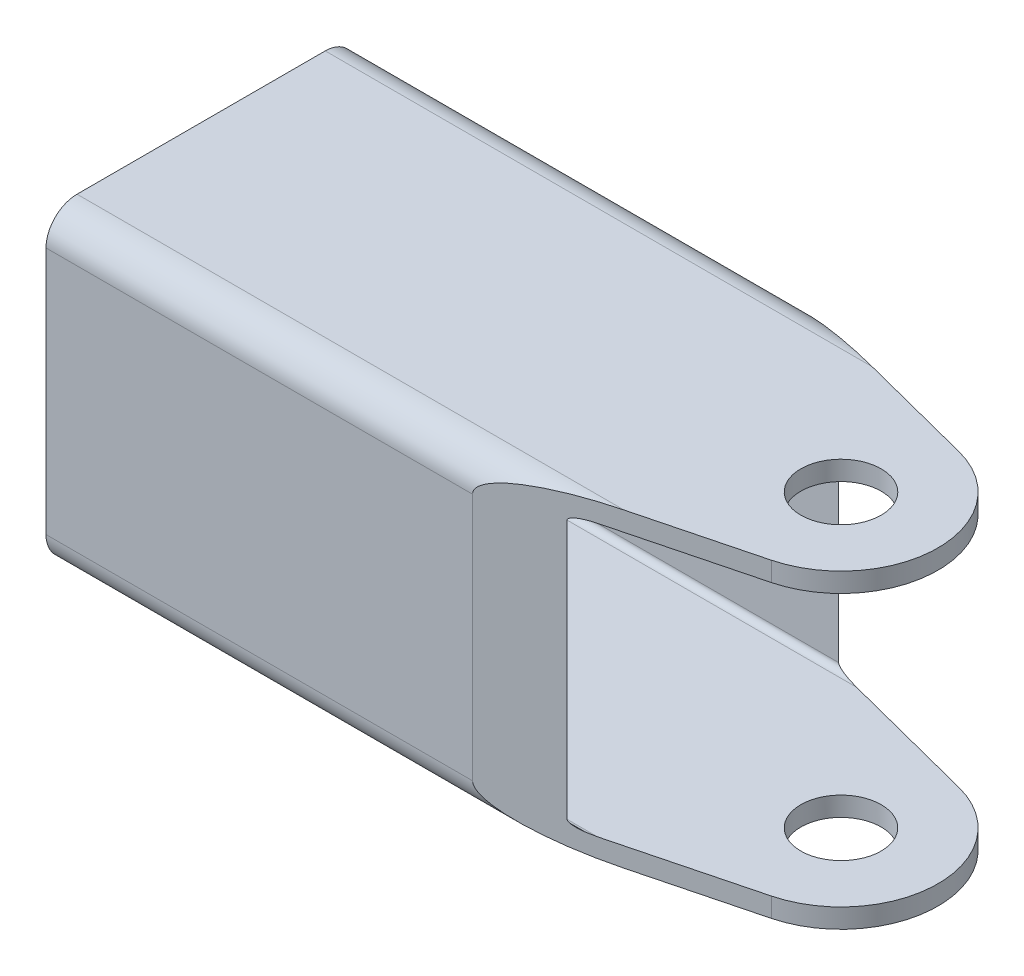
ISO-10303-21;
HEADER;
FILE_DESCRIPTION(('STEP AP214'),'2;1');
FILE_NAME('part.step','',(''),(''),'','','');
FILE_SCHEMA(('AUTOMOTIVE_DESIGN { 1 0 10303 214 1 1 1 1 }'));
ENDSEC;
DATA;
#1=APPLICATION_CONTEXT('core data for automotive mechanical design processes');
#2=APPLICATION_PROTOCOL_DEFINITION('international standard','automotive_design',2000,#1);
#3=PRODUCT_CONTEXT('',#1,'mechanical');
#4=PRODUCT('Part','Part','',(#3));
#5=PRODUCT_RELATED_PRODUCT_CATEGORY('part','',(#4));
#6=PRODUCT_DEFINITION_FORMATION('','',#4);
#7=PRODUCT_DEFINITION_CONTEXT('part definition',#1,'design');
#8=PRODUCT_DEFINITION('design','',#6,#7);
#9=PRODUCT_DEFINITION_SHAPE('','',#8);
#10=(LENGTH_UNIT() NAMED_UNIT(*) SI_UNIT(.MILLI.,.METRE.));
#11=(NAMED_UNIT(*) PLANE_ANGLE_UNIT() SI_UNIT($,.RADIAN.));
#12=(NAMED_UNIT(*) SI_UNIT($,.STERADIAN.) SOLID_ANGLE_UNIT());
#13=UNCERTAINTY_MEASURE_WITH_UNIT(LENGTH_MEASURE(1.E-05),#10,'distance_accuracy_value','');
#14=(GEOMETRIC_REPRESENTATION_CONTEXT(3) GLOBAL_UNCERTAINTY_ASSIGNED_CONTEXT((#13)) GLOBAL_UNIT_ASSIGNED_CONTEXT((#10,
#11,#12)) REPRESENTATION_CONTEXT('',''));
#15=CARTESIAN_POINT('',(0.,0.,0.));
#16=DIRECTION('',(0.,0.,1.));
#17=DIRECTION('',(1.,0.,0.));
#18=AXIS2_PLACEMENT_3D('',#15,#16,#17);
#19=CARTESIAN_POINT('',(-34.925,12.7,10.16));
#20=DIRECTION('',(0.,1.,0.));
#21=DIRECTION('',(0.,0.,1.));
#22=AXIS2_PLACEMENT_3D('',#19,#20,#21);
#23=PLANE('',#22);
#24=CARTESIAN_POINT('',(17.4625,12.7,0.));
#25=DIRECTION('',(0.,1.,0.));
#26=DIRECTION('',(0.,0.,1.));
#27=AXIS2_PLACEMENT_3D('',#24,#25,#26);
#28=CIRCLE('',#27,3.2893);
#29=CARTESIAN_POINT('',(17.4625,12.7,3.2893));
#30=VERTEX_POINT('',#29);
#31=EDGE_CURVE('E481',#30,#30,#28,.T.);
#32=ORIENTED_EDGE('',*,*,#31,.F.);
#33=EDGE_LOOP('',(#32));
#34=FACE_BOUND('',#33,.T.);
#35=CARTESIAN_POINT('',(17.4625,12.7,0.));
#36=DIRECTION('',(0.,1.,0.));
#37=DIRECTION('',(0.,0.,1.));
#38=AXIS2_PLACEMENT_3D('',#35,#36,#37);
#39=CIRCLE('',#38,7.9375);
#40=CARTESIAN_POINT('',(19.4444244631501,12.7,7.68608363683138));
#41=VERTEX_POINT('',#40);
#42=CARTESIAN_POINT('',(19.4444244631501,12.7,-7.68608363683139));
#43=VERTEX_POINT('',#42);
#44=EDGE_CURVE('E206',#41,#43,#39,.T.);
#45=ORIENTED_EDGE('',*,*,#44,.T.);
#46=DIRECTION('',(-0.968325497553561,0.,-0.249691270948044));
#47=VECTOR('',#46,1.);
#48=CARTESIAN_POINT('',(3.07063678702942,12.7,-11.9082092189968));
#49=LINE('',#48,#47);
#50=CARTESIAN_POINT('',(9.85035141375773,12.7,-10.16));
#51=VERTEX_POINT('',#50);
#52=EDGE_CURVE('E213',#43,#51,#49,.T.);
#53=ORIENTED_EDGE('',*,*,#52,.T.);
#54=DIRECTION('',(1.,0.,0.));
#55=VECTOR('',#54,1.);
#56=CARTESIAN_POINT('',(-34.925,12.7,-10.16));
#57=LINE('',#56,#55);
#58=CARTESIAN_POINT('',(-34.925,12.7,-10.16));
#59=VERTEX_POINT('',#58);
#60=EDGE_CURVE('E324',#59,#51,#57,.T.);
#61=ORIENTED_EDGE('',*,*,#60,.F.);
#62=DIRECTION('',(0.,0.,1.));
#63=VECTOR('',#62,1.);
#64=CARTESIAN_POINT('',(-34.925,12.7,10.16));
#65=LINE('',#64,#63);
#66=CARTESIAN_POINT('',(-34.925,12.7,10.16));
#67=VERTEX_POINT('',#66);
#68=EDGE_CURVE('E316',#59,#67,#65,.T.);
#69=ORIENTED_EDGE('',*,*,#68,.T.);
#70=DIRECTION('',(1.,0.,0.));
#71=VECTOR('',#70,1.);
#72=CARTESIAN_POINT('',(-34.925,12.7,10.16));
#73=LINE('',#72,#71);
#74=CARTESIAN_POINT('',(9.85035141375776,12.7,10.16));
#75=VERTEX_POINT('',#74);
#76=EDGE_CURVE('E320',#67,#75,#73,.T.);
#77=ORIENTED_EDGE('',*,*,#76,.T.);
#78=DIRECTION('',(-0.96832549755356,0.,0.249691270948044));
#79=VECTOR('',#78,1.);
#80=CARTESIAN_POINT('',(3.07063678702943,12.7,11.9082092189969));
#81=LINE('',#80,#79);
#82=EDGE_CURVE('E204',#41,#75,#81,.T.);
#83=ORIENTED_EDGE('',*,*,#82,.F.);
#84=EDGE_LOOP('',(#45,#53,#61,#69,#77,#83));
#85=FACE_BOUND('',#84,.T.);
#86=ADVANCED_FACE('F39',(#34,#85),#23,.T.);
#87=CARTESIAN_POINT('',(-34.925,10.16,-10.16));
#88=DIRECTION('',(1.,0.,0.));
#89=DIRECTION('',(0.,0.,-1.));
#90=AXIS2_PLACEMENT_3D('',#87,#88,#89);
#91=CYLINDRICAL_SURFACE('',#90,2.54);
#92=ORIENTED_EDGE('',*,*,#60,.T.);
#93=CARTESIAN_POINT('',(9.85035141375777,10.16,-10.16));
#94=DIRECTION('',(0.249691270948044,0.,-0.968325497553561));
#95=DIRECTION('',(0.968325497553561,0.,0.249691270948044));
#96=AXIS2_PLACEMENT_3D('',#93,#94,#95);
#97=ELLIPSE('',#96,10.1725622620125,2.54);
#98=CARTESIAN_POINT('',(0.,10.16,-12.7));
#99=VERTEX_POINT('',#98);
#100=EDGE_CURVE('E248',#51,#99,#97,.F.);
#101=ORIENTED_EDGE('',*,*,#100,.T.);
#102=DIRECTION('',(1.,0.,0.));
#103=VECTOR('',#102,1.);
#104=CARTESIAN_POINT('',(-34.925,10.16,-12.7));
#105=LINE('',#104,#103);
#106=CARTESIAN_POINT('',(-34.925,10.16,-12.7));
#107=VERTEX_POINT('',#106);
#108=EDGE_CURVE('E327',#107,#99,#105,.T.);
#109=ORIENTED_EDGE('',*,*,#108,.F.);
#110=CARTESIAN_POINT('',(-34.925,10.16,-10.16));
#111=DIRECTION('',(1.,0.,0.));
#112=DIRECTION('',(0.,0.,1.));
#113=AXIS2_PLACEMENT_3D('',#110,#111,#112);
#114=CIRCLE('',#113,2.54);
#115=EDGE_CURVE('E313',#107,#59,#114,.T.);
#116=ORIENTED_EDGE('',*,*,#115,.T.);
#117=EDGE_LOOP('',(#92,#101,#109,#116));
#118=FACE_BOUND('',#117,.T.);
#119=ADVANCED_FACE('F391',(#118),#91,.T.);
#120=CARTESIAN_POINT('',(-34.925,10.16,-12.7));
#121=DIRECTION('',(0.,0.,-1.));
#122=DIRECTION('',(-1.,0.,0.));
#123=AXIS2_PLACEMENT_3D('',#120,#121,#122);
#124=PLANE('',#123);
#125=ORIENTED_EDGE('',*,*,#108,.T.);
#126=DIRECTION('',(0.,1.,0.));
#127=VECTOR('',#126,1.);
#128=CARTESIAN_POINT('',(0.,-12.7,-12.7));
#129=LINE('',#128,#127);
#130=CARTESIAN_POINT('',(0.,-10.16,-12.7));
#131=VERTEX_POINT('',#130);
#132=EDGE_CURVE('E217',#131,#99,#129,.T.);
#133=ORIENTED_EDGE('',*,*,#132,.F.);
#134=DIRECTION('',(1.,0.,0.));
#135=VECTOR('',#134,1.);
#136=CARTESIAN_POINT('',(-34.925,-10.16,-12.7));
#137=LINE('',#136,#135);
#138=CARTESIAN_POINT('',(-34.925,-10.16,-12.7));
#139=VERTEX_POINT('',#138);
#140=EDGE_CURVE('E330',#139,#131,#137,.T.);
#141=ORIENTED_EDGE('',*,*,#140,.F.);
#142=DIRECTION('',(0.,1.,0.));
#143=VECTOR('',#142,1.);
#144=CARTESIAN_POINT('',(-34.925,10.16,-12.7));
#145=LINE('',#144,#143);
#146=EDGE_CURVE('E310',#139,#107,#145,.T.);
#147=ORIENTED_EDGE('',*,*,#146,.T.);
#148=EDGE_LOOP('',(#125,#133,#141,#147));
#149=FACE_BOUND('',#148,.T.);
#150=ADVANCED_FACE('F394',(#149),#124,.T.);
#151=CARTESIAN_POINT('',(-34.925,-10.16,-10.16));
#152=DIRECTION('',(1.,0.,0.));
#153=DIRECTION('',(0.,0.,-1.));
#154=AXIS2_PLACEMENT_3D('',#151,#152,#153);
#155=CYLINDRICAL_SURFACE('',#154,2.54);
#156=ORIENTED_EDGE('',*,*,#140,.T.);
#157=CARTESIAN_POINT('',(9.85035141375777,-10.16,-10.16));
#158=DIRECTION('',(0.249691270948044,0.,-0.968325497553561));
#159=DIRECTION('',(0.968325497553561,0.,0.249691270948044));
#160=AXIS2_PLACEMENT_3D('',#157,#158,#159);
#161=ELLIPSE('',#160,10.1725622620125,2.54);
#162=CARTESIAN_POINT('',(9.85035141375775,-12.7,-10.16));
#163=VERTEX_POINT('',#162);
#164=EDGE_CURVE('E246',#131,#163,#161,.F.);
#165=ORIENTED_EDGE('',*,*,#164,.T.);
#166=DIRECTION('',(1.,0.,0.));
#167=VECTOR('',#166,1.);
#168=CARTESIAN_POINT('',(-34.925,-12.7,-10.16));
#169=LINE('',#168,#167);
#170=CARTESIAN_POINT('',(-34.925,-12.7,-10.16));
#171=VERTEX_POINT('',#170);
#172=EDGE_CURVE('E203',#171,#163,#169,.T.);
#173=ORIENTED_EDGE('',*,*,#172,.F.);
#174=CARTESIAN_POINT('',(-34.925,-10.16,-10.16));
#175=DIRECTION('',(1.,0.,0.));
#176=DIRECTION('',(0.,0.,1.));
#177=AXIS2_PLACEMENT_3D('',#174,#175,#176);
#178=CIRCLE('',#177,2.54);
#179=EDGE_CURVE('E307',#171,#139,#178,.T.);
#180=ORIENTED_EDGE('',*,*,#179,.T.);
#181=EDGE_LOOP('',(#156,#165,#173,#180));
#182=FACE_BOUND('',#181,.T.);
#183=ADVANCED_FACE('F397',(#182),#155,.T.);
#184=CARTESIAN_POINT('',(-34.925,-12.7,10.16));
#185=DIRECTION('',(0.,-1.,0.));
#186=DIRECTION('',(0.,0.,-1.));
#187=AXIS2_PLACEMENT_3D('',#184,#185,#186);
#188=PLANE('',#187);
#189=CARTESIAN_POINT('',(17.4625,-12.7,0.));
#190=DIRECTION('',(0.,1.,0.));
#191=DIRECTION('',(0.,0.,1.));
#192=AXIS2_PLACEMENT_3D('',#189,#190,#191);
#193=CIRCLE('',#192,3.2893);
#194=CARTESIAN_POINT('',(17.4625,-12.7,3.2893));
#195=VERTEX_POINT('',#194);
#196=EDGE_CURVE('E475',#195,#195,#193,.T.);
#197=ORIENTED_EDGE('',*,*,#196,.T.);
#198=EDGE_LOOP('',(#197));
#199=FACE_BOUND('',#198,.T.);
#200=ORIENTED_EDGE('',*,*,#172,.T.);
#201=DIRECTION('',(-0.968325497553561,0.,-0.249691270948044));
#202=VECTOR('',#201,1.);
#203=CARTESIAN_POINT('',(3.07063678702942,-12.7,-11.9082092189968));
#204=LINE('',#203,#202);
#205=CARTESIAN_POINT('',(19.4444244631501,-12.7,-7.68608363683138));
#206=VERTEX_POINT('',#205);
#207=EDGE_CURVE('E189',#206,#163,#204,.T.);
#208=ORIENTED_EDGE('',*,*,#207,.F.);
#209=CARTESIAN_POINT('',(17.4625,-12.7,0.));
#210=DIRECTION('',(0.,1.,0.));
#211=DIRECTION('',(0.,0.,1.));
#212=AXIS2_PLACEMENT_3D('',#209,#210,#211);
#213=CIRCLE('',#212,7.9375);
#214=CARTESIAN_POINT('',(19.4444244631501,-12.7,7.68608363683139));
#215=VERTEX_POINT('',#214);
#216=EDGE_CURVE('E177',#215,#206,#213,.T.);
#217=ORIENTED_EDGE('',*,*,#216,.F.);
#218=DIRECTION('',(-0.96832549755356,0.,0.249691270948044));
#219=VECTOR('',#218,1.);
#220=CARTESIAN_POINT('',(3.07063678702943,-12.7,11.9082092189969));
#221=LINE('',#220,#219);
#222=CARTESIAN_POINT('',(9.85035141375782,-12.7,10.16));
#223=VERTEX_POINT('',#222);
#224=EDGE_CURVE('E188',#215,#223,#221,.T.);
#225=ORIENTED_EDGE('',*,*,#224,.T.);
#226=DIRECTION('',(1.,0.,0.));
#227=VECTOR('',#226,1.);
#228=CARTESIAN_POINT('',(-34.925,-12.7,10.16));
#229=LINE('',#228,#227);
#230=CARTESIAN_POINT('',(-34.925,-12.7,10.16));
#231=VERTEX_POINT('',#230);
#232=EDGE_CURVE('E334',#231,#223,#229,.T.);
#233=ORIENTED_EDGE('',*,*,#232,.F.);
#234=DIRECTION('',(0.,0.,-1.));
#235=VECTOR('',#234,1.);
#236=CARTESIAN_POINT('',(-34.925,-12.7,10.16));
#237=LINE('',#236,#235);
#238=EDGE_CURVE('E305',#231,#171,#237,.T.);
#239=ORIENTED_EDGE('',*,*,#238,.T.);
#240=EDGE_LOOP('',(#200,#208,#217,#225,#233,#239));
#241=FACE_BOUND('',#240,.T.);
#242=ADVANCED_FACE('F201',(#199,#241),#188,.T.);
#243=CARTESIAN_POINT('',(-34.925,10.6045,-10.6045));
#244=DIRECTION('',(1.,0.,0.));
#245=DIRECTION('',(0.,0.,-1.));
#246=AXIS2_PLACEMENT_3D('',#243,#244,#245);
#247=CYLINDRICAL_SURFACE('',#246,0.508000000000001);
#248=CARTESIAN_POINT('',(8.12653991635016,10.6045,-10.6045));
#249=DIRECTION('',(0.249691270948044,0.,-0.968325497553561));
#250=DIRECTION('',(0.968325497553561,0.,0.249691270948044));
#251=AXIS2_PLACEMENT_3D('',#248,#249,#250);
#252=ELLIPSE('',#251,2.0345124524025,0.508000000000001);
#253=CARTESIAN_POINT('',(8.12653991635019,11.1125,-10.6045));
#254=VERTEX_POINT('',#253);
#255=CARTESIAN_POINT('',(6.15646963359859,10.6045,-11.1125));
#256=VERTEX_POINT('',#255);
#257=EDGE_CURVE('E239',#254,#256,#252,.F.);
#258=ORIENTED_EDGE('',*,*,#257,.F.);
#259=DIRECTION('',(1.,0.,0.));
#260=VECTOR('',#259,1.);
#261=CARTESIAN_POINT('',(-34.925,11.1125,-10.6045));
#262=LINE('',#261,#260);
#263=CARTESIAN_POINT('',(-34.925,11.1125,-10.6045));
#264=VERTEX_POINT('',#263);
#265=EDGE_CURVE('E273',#264,#254,#262,.T.);
#266=ORIENTED_EDGE('',*,*,#265,.F.);
#267=CARTESIAN_POINT('',(-34.925,10.6045,-10.6045));
#268=DIRECTION('',(1.,0.,0.));
#269=DIRECTION('',(0.,0.,1.));
#270=AXIS2_PLACEMENT_3D('',#267,#268,#269);
#271=CIRCLE('',#270,0.508000000000001);
#272=CARTESIAN_POINT('',(-34.925,10.6045,-11.1125));
#273=VERTEX_POINT('',#272);
#274=EDGE_CURVE('E251',#273,#264,#271,.T.);
#275=ORIENTED_EDGE('',*,*,#274,.F.);
#276=DIRECTION('',(1.,0.,0.));
#277=VECTOR('',#276,1.);
#278=CARTESIAN_POINT('',(-34.925,10.6045,-11.1125));
#279=LINE('',#278,#277);
#280=EDGE_CURVE('E274',#273,#256,#279,.T.);
#281=ORIENTED_EDGE('',*,*,#280,.T.);
#282=EDGE_LOOP('',(#258,#266,#275,#281));
#283=FACE_BOUND('',#282,.T.);
#284=ADVANCED_FACE('F361',(#283),#247,.F.);
#285=CARTESIAN_POINT('',(-34.925,10.6045,-11.1125));
#286=DIRECTION('',(0.,0.,-1.));
#287=DIRECTION('',(0.,1.,0.));
#288=AXIS2_PLACEMENT_3D('',#285,#286,#287);
#289=PLANE('',#288);
#290=DIRECTION('',(0.,-1.,0.));
#291=VECTOR('',#290,1.);
#292=CARTESIAN_POINT('',(6.1564696335986,10.6045,-11.1125));
#293=LINE('',#292,#291);
#294=CARTESIAN_POINT('',(6.15646963359857,-10.6045,-11.1125));
#295=VERTEX_POINT('',#294);
#296=EDGE_CURVE('E241',#256,#295,#293,.T.);
#297=ORIENTED_EDGE('',*,*,#296,.F.);
#298=ORIENTED_EDGE('',*,*,#280,.F.);
#299=DIRECTION('',(0.,1.,0.));
#300=VECTOR('',#299,1.);
#301=CARTESIAN_POINT('',(-34.925,10.6045,-11.1125));
#302=LINE('',#301,#300);
#303=CARTESIAN_POINT('',(-34.925,-10.6045,-11.1125));
#304=VERTEX_POINT('',#303);
#305=EDGE_CURVE('E270',#304,#273,#302,.T.);
#306=ORIENTED_EDGE('',*,*,#305,.F.);
#307=DIRECTION('',(1.,0.,0.));
#308=VECTOR('',#307,1.);
#309=CARTESIAN_POINT('',(-34.925,-10.6045,-11.1125));
#310=LINE('',#309,#308);
#311=EDGE_CURVE('E278',#304,#295,#310,.T.);
#312=ORIENTED_EDGE('',*,*,#311,.T.);
#313=EDGE_LOOP('',(#297,#298,#306,#312));
#314=FACE_BOUND('',#313,.T.);
#315=ADVANCED_FACE('F366',(#314),#289,.F.);
#316=CARTESIAN_POINT('',(-34.925,-10.6045,-10.6045));
#317=DIRECTION('',(1.,0.,0.));
#318=DIRECTION('',(0.,0.,-1.));
#319=AXIS2_PLACEMENT_3D('',#316,#317,#318);
#320=CYLINDRICAL_SURFACE('',#319,0.508);
#321=CARTESIAN_POINT('',(8.12653991635013,-10.6045,-10.6045));
#322=DIRECTION('',(0.249691270948044,0.,-0.968325497553561));
#323=DIRECTION('',(0.968325497553561,0.,0.249691270948044));
#324=AXIS2_PLACEMENT_3D('',#321,#322,#323);
#325=ELLIPSE('',#324,2.03451245240249,0.508);
#326=CARTESIAN_POINT('',(8.12653991635014,-11.1125,-10.6045));
#327=VERTEX_POINT('',#326);
#328=EDGE_CURVE('E243',#295,#327,#325,.F.);
#329=ORIENTED_EDGE('',*,*,#328,.F.);
#330=ORIENTED_EDGE('',*,*,#311,.F.);
#331=CARTESIAN_POINT('',(-34.925,-10.6045,-10.6045));
#332=DIRECTION('',(1.,0.,0.));
#333=DIRECTION('',(0.,0.,-1.));
#334=AXIS2_PLACEMENT_3D('',#331,#332,#333);
#335=CIRCLE('',#334,0.508);
#336=CARTESIAN_POINT('',(-34.925,-11.1125,-10.6045));
#337=VERTEX_POINT('',#336);
#338=EDGE_CURVE('E267',#337,#304,#335,.T.);
#339=ORIENTED_EDGE('',*,*,#338,.F.);
#340=DIRECTION('',(1.,0.,0.));
#341=VECTOR('',#340,1.);
#342=CARTESIAN_POINT('',(-34.925,-11.1125,-10.6045));
#343=LINE('',#342,#341);
#344=EDGE_CURVE('E281',#337,#327,#343,.T.);
#345=ORIENTED_EDGE('',*,*,#344,.T.);
#346=EDGE_LOOP('',(#329,#330,#339,#345));
#347=FACE_BOUND('',#346,.T.);
#348=ADVANCED_FACE('F370',(#347),#320,.F.);
#349=CARTESIAN_POINT('',(-34.925,-11.1125,10.6045));
#350=DIRECTION('',(0.,-1.,0.));
#351=DIRECTION('',(0.,0.,-1.));
#352=AXIS2_PLACEMENT_3D('',#349,#350,#351);
#353=PLANE('',#352);
#354=CARTESIAN_POINT('',(17.4625,-11.1125,0.));
#355=DIRECTION('',(0.,-1.,0.));
#356=DIRECTION('',(0.,0.,-1.));
#357=AXIS2_PLACEMENT_3D('',#354,#355,#356);
#358=CIRCLE('',#357,3.2893);
#359=CARTESIAN_POINT('',(17.4625,-11.1125,-3.2893));
#360=VERTEX_POINT('',#359);
#361=EDGE_CURVE('E209',#360,#360,#358,.T.);
#362=ORIENTED_EDGE('',*,*,#361,.T.);
#363=EDGE_LOOP('',(#362));
#364=FACE_BOUND('',#363,.T.);
#365=DIRECTION('',(0.968325497553561,0.,0.249691270948044));
#366=VECTOR('',#365,1.);
#367=CARTESIAN_POINT('',(-27.1129568480424,-11.1125,-19.6913150811901));
#368=LINE('',#367,#366);
#369=CARTESIAN_POINT('',(19.4444244631501,-11.1125,-7.68608363683138));
#370=VERTEX_POINT('',#369);
#371=EDGE_CURVE('E196',#327,#370,#368,.T.);
#372=ORIENTED_EDGE('',*,*,#371,.F.);
#373=ORIENTED_EDGE('',*,*,#344,.F.);
#374=DIRECTION('',(0.,0.,-1.));
#375=VECTOR('',#374,1.);
#376=CARTESIAN_POINT('',(-34.925,-11.1125,10.6045));
#377=LINE('',#376,#375);
#378=CARTESIAN_POINT('',(-34.925,-11.1125,10.6045));
#379=VERTEX_POINT('',#378);
#380=EDGE_CURVE('E264',#379,#337,#377,.T.);
#381=ORIENTED_EDGE('',*,*,#380,.F.);
#382=DIRECTION('',(1.,0.,0.));
#383=VECTOR('',#382,1.);
#384=CARTESIAN_POINT('',(-34.925,-11.1125,10.6045));
#385=LINE('',#384,#383);
#386=CARTESIAN_POINT('',(8.12653991635018,-11.1125,10.6045));
#387=VERTEX_POINT('',#386);
#388=EDGE_CURVE('E284',#379,#387,#385,.T.);
#389=ORIENTED_EDGE('',*,*,#388,.T.);
#390=DIRECTION('',(0.96832549755356,0.,-0.249691270948044));
#391=VECTOR('',#390,1.);
#392=CARTESIAN_POINT('',(-32.2409202823815,-11.1125,21.0136056854654));
#393=LINE('',#392,#391);
#394=CARTESIAN_POINT('',(19.4444244631501,-11.1125,7.68608363683139));
#395=VERTEX_POINT('',#394);
#396=EDGE_CURVE('E233',#387,#395,#393,.T.);
#397=ORIENTED_EDGE('',*,*,#396,.T.);
#398=CARTESIAN_POINT('',(17.4625,-11.1125,0.));
#399=DIRECTION('',(0.,-1.,0.));
#400=DIRECTION('',(0.,0.,-1.));
#401=AXIS2_PLACEMENT_3D('',#398,#399,#400);
#402=CIRCLE('',#401,7.9375);
#403=EDGE_CURVE('E219',#370,#395,#402,.T.);
#404=ORIENTED_EDGE('',*,*,#403,.F.);
#405=EDGE_LOOP('',(#372,#373,#381,#389,#397,#404));
#406=FACE_BOUND('',#405,.T.);
#407=ADVANCED_FACE('F372',(#364,#406),#353,.F.);
#408=CARTESIAN_POINT('',(-34.925,11.1125,10.6045));
#409=DIRECTION('',(0.,1.,0.));
#410=DIRECTION('',(0.,0.,1.));
#411=AXIS2_PLACEMENT_3D('',#408,#409,#410);
#412=PLANE('',#411);
#413=CARTESIAN_POINT('',(17.4625,11.1125,0.));
#414=DIRECTION('',(0.,1.,0.));
#415=DIRECTION('',(0.,0.,1.));
#416=AXIS2_PLACEMENT_3D('',#413,#414,#415);
#417=CIRCLE('',#416,3.2893);
#418=CARTESIAN_POINT('',(17.4625,11.1125,3.2893));
#419=VERTEX_POINT('',#418);
#420=EDGE_CURVE('E43',#419,#419,#417,.T.);
#421=ORIENTED_EDGE('',*,*,#420,.T.);
#422=EDGE_LOOP('',(#421));
#423=FACE_BOUND('',#422,.T.);
#424=DIRECTION('',(-0.968325497553561,0.,-0.249691270948044));
#425=VECTOR('',#424,1.);
#426=CARTESIAN_POINT('',(-27.1129568480424,11.1125,-19.6913150811901));
#427=LINE('',#426,#425);
#428=CARTESIAN_POINT('',(19.4444244631501,11.1125,-7.68608363683139));
#429=VERTEX_POINT('',#428);
#430=EDGE_CURVE('E11',#429,#254,#427,.T.);
#431=ORIENTED_EDGE('',*,*,#430,.F.);
#432=CARTESIAN_POINT('',(17.4625,11.1125,0.));
#433=DIRECTION('',(0.,1.,0.));
#434=DIRECTION('',(0.,0.,1.));
#435=AXIS2_PLACEMENT_3D('',#432,#433,#434);
#436=CIRCLE('',#435,7.9375);
#437=CARTESIAN_POINT('',(19.4444244631501,11.1125,7.68608363683138));
#438=VERTEX_POINT('',#437);
#439=EDGE_CURVE('E323',#438,#429,#436,.T.);
#440=ORIENTED_EDGE('',*,*,#439,.F.);
#441=DIRECTION('',(-0.96832549755356,0.,0.249691270948044));
#442=VECTOR('',#441,1.);
#443=CARTESIAN_POINT('',(-32.2409202823815,11.1125,21.0136056854654));
#444=LINE('',#443,#442);
#445=CARTESIAN_POINT('',(8.12653991635014,11.1125,10.6045));
#446=VERTEX_POINT('',#445);
#447=EDGE_CURVE('E48',#438,#446,#444,.T.);
#448=ORIENTED_EDGE('',*,*,#447,.T.);
#449=DIRECTION('',(1.,0.,0.));
#450=VECTOR('',#449,1.);
#451=CARTESIAN_POINT('',(-34.925,11.1125,10.6045));
#452=LINE('',#451,#450);
#453=CARTESIAN_POINT('',(-34.925,11.1125,10.6045));
#454=VERTEX_POINT('',#453);
#455=EDGE_CURVE('E293',#454,#446,#452,.T.);
#456=ORIENTED_EDGE('',*,*,#455,.F.);
#457=DIRECTION('',(0.,0.,1.));
#458=VECTOR('',#457,1.);
#459=CARTESIAN_POINT('',(-34.925,11.1125,10.6045));
#460=LINE('',#459,#458);
#461=EDGE_CURVE('E254',#264,#454,#460,.T.);
#462=ORIENTED_EDGE('',*,*,#461,.F.);
#463=ORIENTED_EDGE('',*,*,#265,.T.);
#464=EDGE_LOOP('',(#431,#440,#448,#456,#462,#463));
#465=FACE_BOUND('',#464,.T.);
#466=ADVANCED_FACE('F347',(#423,#465),#412,.F.);
#467=CARTESIAN_POINT('',(-34.925,10.16,10.16));
#468=DIRECTION('',(1.,0.,0.));
#469=DIRECTION('',(0.,0.,-1.));
#470=AXIS2_PLACEMENT_3D('',#467,#468,#469);
#471=CYLINDRICAL_SURFACE('',#470,2.54);
#472=CARTESIAN_POINT('',(9.85035141375779,10.16,10.16));
#473=DIRECTION('',(-0.249691270948044,0.,-0.96832549755356));
#474=DIRECTION('',(0.96832549755356,0.,-0.249691270948044));
#475=AXIS2_PLACEMENT_3D('',#472,#473,#474);
#476=ELLIPSE('',#475,10.1725622620125,2.54);
#477=CARTESIAN_POINT('',(0.,10.16,12.7));
#478=VERTEX_POINT('',#477);
#479=EDGE_CURVE('E55',#75,#478,#476,.F.);
#480=ORIENTED_EDGE('',*,*,#479,.F.);
#481=ORIENTED_EDGE('',*,*,#76,.F.);
#482=CARTESIAN_POINT('',(-34.925,10.16,10.16));
#483=DIRECTION('',(1.,0.,0.));
#484=DIRECTION('',(0.,0.,-1.));
#485=AXIS2_PLACEMENT_3D('',#482,#483,#484);
#486=CIRCLE('',#485,2.54);
#487=CARTESIAN_POINT('',(-34.925,10.16,12.7));
#488=VERTEX_POINT('',#487);
#489=EDGE_CURVE('E277',#67,#488,#486,.T.);
#490=ORIENTED_EDGE('',*,*,#489,.T.);
#491=DIRECTION('',(1.,0.,0.));
#492=VECTOR('',#491,1.);
#493=CARTESIAN_POINT('',(-34.925,10.16,12.7));
#494=LINE('',#493,#492);
#495=EDGE_CURVE('E319',#488,#478,#494,.T.);
#496=ORIENTED_EDGE('',*,*,#495,.T.);
#497=EDGE_LOOP('',(#480,#481,#490,#496));
#498=FACE_BOUND('',#497,.T.);
#499=ADVANCED_FACE('F41',(#498),#471,.T.);
#500=CARTESIAN_POINT('',(-34.925,-10.16,10.16));
#501=DIRECTION('',(1.,0.,0.));
#502=DIRECTION('',(0.,0.,-1.));
#503=AXIS2_PLACEMENT_3D('',#500,#501,#502);
#504=CYLINDRICAL_SURFACE('',#503,2.54);
#505=CARTESIAN_POINT('',(9.8503514137578,-10.16,10.16));
#506=DIRECTION('',(-0.249691270948044,0.,-0.96832549755356));
#507=DIRECTION('',(0.96832549755356,0.,-0.249691270948044));
#508=AXIS2_PLACEMENT_3D('',#505,#506,#507);
#509=ELLIPSE('',#508,10.1725622620125,2.54);
#510=CARTESIAN_POINT('',(0.,-10.16,12.7));
#511=VERTEX_POINT('',#510);
#512=EDGE_CURVE('E236',#511,#223,#509,.F.);
#513=ORIENTED_EDGE('',*,*,#512,.F.);
#514=DIRECTION('',(1.,0.,0.));
#515=VECTOR('',#514,1.);
#516=CARTESIAN_POINT('',(-34.925,-10.16,12.7));
#517=LINE('',#516,#515);
#518=CARTESIAN_POINT('',(-34.925,-10.16,12.7));
#519=VERTEX_POINT('',#518);
#520=EDGE_CURVE('E337',#519,#511,#517,.T.);
#521=ORIENTED_EDGE('',*,*,#520,.F.);
#522=CARTESIAN_POINT('',(-34.925,-10.16,10.16));
#523=DIRECTION('',(1.,0.,0.));
#524=DIRECTION('',(0.,0.,1.));
#525=AXIS2_PLACEMENT_3D('',#522,#523,#524);
#526=CIRCLE('',#525,2.54);
#527=EDGE_CURVE('E302',#519,#231,#526,.T.);
#528=ORIENTED_EDGE('',*,*,#527,.T.);
#529=ORIENTED_EDGE('',*,*,#232,.T.);
#530=EDGE_LOOP('',(#513,#521,#528,#529));
#531=FACE_BOUND('',#530,.T.);
#532=ADVANCED_FACE('F378',(#531),#504,.T.);
#533=CARTESIAN_POINT('',(-34.925,10.16,12.7));
#534=DIRECTION('',(0.,0.,1.));
#535=DIRECTION('',(1.,0.,0.));
#536=AXIS2_PLACEMENT_3D('',#533,#534,#535);
#537=PLANE('',#536);
#538=DIRECTION('',(0.,1.,0.));
#539=VECTOR('',#538,1.);
#540=CARTESIAN_POINT('',(0.,-12.7,12.7));
#541=LINE('',#540,#539);
#542=EDGE_CURVE('E220',#511,#478,#541,.T.);
#543=ORIENTED_EDGE('',*,*,#542,.T.);
#544=ORIENTED_EDGE('',*,*,#495,.F.);
#545=DIRECTION('',(0.,-1.,0.));
#546=VECTOR('',#545,1.);
#547=CARTESIAN_POINT('',(-34.925,10.16,12.7));
#548=LINE('',#547,#546);
#549=EDGE_CURVE('E299',#488,#519,#548,.T.);
#550=ORIENTED_EDGE('',*,*,#549,.T.);
#551=ORIENTED_EDGE('',*,*,#520,.T.);
#552=EDGE_LOOP('',(#543,#544,#550,#551));
#553=FACE_BOUND('',#552,.T.);
#554=ADVANCED_FACE('F384',(#553),#537,.T.);
#555=CARTESIAN_POINT('',(-34.925,10.16,10.16));
#556=DIRECTION('',(1.,0.,0.));
#557=DIRECTION('',(0.,0.,-1.));
#558=AXIS2_PLACEMENT_3D('',#555,#556,#557);
#559=PLANE('',#558);
#560=ORIENTED_EDGE('',*,*,#305,.T.);
#561=ORIENTED_EDGE('',*,*,#274,.T.);
#562=ORIENTED_EDGE('',*,*,#461,.T.);
#563=CARTESIAN_POINT('',(-34.925,10.6045,10.6045));
#564=DIRECTION('',(1.,0.,0.));
#565=DIRECTION('',(0.,0.,-1.));
#566=AXIS2_PLACEMENT_3D('',#563,#564,#565);
#567=CIRCLE('',#566,0.507999999999997);
#568=CARTESIAN_POINT('',(-34.925,10.6045,11.1125));
#569=VERTEX_POINT('',#568);
#570=EDGE_CURVE('E63',#454,#569,#567,.T.);
#571=ORIENTED_EDGE('',*,*,#570,.T.);
#572=DIRECTION('',(0.,-1.,0.));
#573=VECTOR('',#572,1.);
#574=CARTESIAN_POINT('',(-34.925,10.6045,11.1125));
#575=LINE('',#574,#573);
#576=CARTESIAN_POINT('',(-34.925,-10.6045,11.1125));
#577=VERTEX_POINT('',#576);
#578=EDGE_CURVE('E258',#569,#577,#575,.T.);
#579=ORIENTED_EDGE('',*,*,#578,.T.);
#580=CARTESIAN_POINT('',(-34.925,-10.6045,10.6045));
#581=DIRECTION('',(1.,0.,0.));
#582=DIRECTION('',(0.,0.,-1.));
#583=AXIS2_PLACEMENT_3D('',#580,#581,#582);
#584=CIRCLE('',#583,0.508000000000001);
#585=EDGE_CURVE('E261',#577,#379,#584,.T.);
#586=ORIENTED_EDGE('',*,*,#585,.T.);
#587=ORIENTED_EDGE('',*,*,#380,.T.);
#588=ORIENTED_EDGE('',*,*,#338,.T.);
#589=EDGE_LOOP('',(#560,#561,#562,#571,#579,#586,#587,#588));
#590=FACE_BOUND('',#589,.T.);
#591=ORIENTED_EDGE('',*,*,#489,.F.);
#592=ORIENTED_EDGE('',*,*,#68,.F.);
#593=ORIENTED_EDGE('',*,*,#115,.F.);
#594=ORIENTED_EDGE('',*,*,#146,.F.);
#595=ORIENTED_EDGE('',*,*,#179,.F.);
#596=ORIENTED_EDGE('',*,*,#238,.F.);
#597=ORIENTED_EDGE('',*,*,#527,.F.);
#598=ORIENTED_EDGE('',*,*,#549,.F.);
#599=EDGE_LOOP('',(#591,#592,#593,#594,#595,#596,#597,#598));
#600=FACE_BOUND('',#599,.T.);
#601=ADVANCED_FACE('F356',(#590,#600),#559,.F.);
#602=CARTESIAN_POINT('',(-34.925,-10.6045,10.6045));
#603=DIRECTION('',(1.,0.,0.));
#604=DIRECTION('',(0.,0.,-1.));
#605=AXIS2_PLACEMENT_3D('',#602,#603,#604);
#606=CYLINDRICAL_SURFACE('',#605,0.508000000000001);
#607=DIRECTION('',(1.,0.,0.));
#608=VECTOR('',#607,1.);
#609=CARTESIAN_POINT('',(-34.925,-10.6045,11.1125));
#610=LINE('',#609,#608);
#611=CARTESIAN_POINT('',(6.15646963359864,-10.6045,11.1125));
#612=VERTEX_POINT('',#611);
#613=EDGE_CURVE('E287',#577,#612,#610,.T.);
#614=ORIENTED_EDGE('',*,*,#613,.T.);
#615=CARTESIAN_POINT('',(8.12653991635019,-10.6045,10.6045));
#616=DIRECTION('',(-0.249691270948044,0.,-0.96832549755356));
#617=DIRECTION('',(0.968325497553561,0.,-0.249691270948044));
#618=AXIS2_PLACEMENT_3D('',#615,#616,#617);
#619=ELLIPSE('',#618,2.03451245240249,0.508000000000001);
#620=EDGE_CURVE('E230',#612,#387,#619,.F.);
#621=ORIENTED_EDGE('',*,*,#620,.T.);
#622=ORIENTED_EDGE('',*,*,#388,.F.);
#623=ORIENTED_EDGE('',*,*,#585,.F.);
#624=EDGE_LOOP('',(#614,#621,#622,#623));
#625=FACE_BOUND('',#624,.T.);
#626=ADVANCED_FACE('F437',(#625),#606,.F.);
#627=CARTESIAN_POINT('',(-34.925,10.6045,11.1125));
#628=DIRECTION('',(0.,0.,1.));
#629=DIRECTION('',(1.,0.,0.));
#630=AXIS2_PLACEMENT_3D('',#627,#628,#629);
#631=PLANE('',#630);
#632=DIRECTION('',(1.,0.,0.));
#633=VECTOR('',#632,1.);
#634=CARTESIAN_POINT('',(-34.925,10.6045,11.1125));
#635=LINE('',#634,#633);
#636=CARTESIAN_POINT('',(6.1564696335986,10.6045,11.1125));
#637=VERTEX_POINT('',#636);
#638=EDGE_CURVE('E290',#569,#637,#635,.T.);
#639=ORIENTED_EDGE('',*,*,#638,.T.);
#640=DIRECTION('',(0.,-1.,0.));
#641=VECTOR('',#640,1.);
#642=CARTESIAN_POINT('',(6.15646963359863,10.6045,11.1125));
#643=LINE('',#642,#641);
#644=EDGE_CURVE('E227',#637,#612,#643,.T.);
#645=ORIENTED_EDGE('',*,*,#644,.T.);
#646=ORIENTED_EDGE('',*,*,#613,.F.);
#647=ORIENTED_EDGE('',*,*,#578,.F.);
#648=EDGE_LOOP('',(#639,#645,#646,#647));
#649=FACE_BOUND('',#648,.T.);
#650=ADVANCED_FACE('F353',(#649),#631,.F.);
#651=CARTESIAN_POINT('',(-34.925,10.6045,10.6045));
#652=DIRECTION('',(1.,0.,0.));
#653=DIRECTION('',(0.,0.,-1.));
#654=AXIS2_PLACEMENT_3D('',#651,#652,#653);
#655=CYLINDRICAL_SURFACE('',#654,0.507999999999997);
#656=ORIENTED_EDGE('',*,*,#455,.T.);
#657=CARTESIAN_POINT('',(8.12653991635015,10.6045,10.6045));
#658=DIRECTION('',(-0.249691270948044,0.,-0.96832549755356));
#659=DIRECTION('',(0.968325497553561,0.,-0.249691270948044));
#660=AXIS2_PLACEMENT_3D('',#657,#658,#659);
#661=ELLIPSE('',#660,2.03451245240248,0.507999999999997);
#662=EDGE_CURVE('E224',#446,#637,#661,.F.);
#663=ORIENTED_EDGE('',*,*,#662,.T.);
#664=ORIENTED_EDGE('',*,*,#638,.F.);
#665=ORIENTED_EDGE('',*,*,#570,.F.);
#666=EDGE_LOOP('',(#656,#663,#664,#665));
#667=FACE_BOUND('',#666,.T.);
#668=ADVANCED_FACE('F350',(#667),#655,.F.);
#669=CARTESIAN_POINT('',(3.07063678702942,-12.7,-11.9082092189968));
#670=DIRECTION('',(0.249691270948044,0.,-0.968325497553561));
#671=DIRECTION('',(-0.968325497553561,0.,-0.249691270948044));
#672=AXIS2_PLACEMENT_3D('',#669,#670,#671);
#673=PLANE('',#672);
#674=ORIENTED_EDGE('',*,*,#52,.F.);
#675=DIRECTION('',(0.,1.,0.));
#676=VECTOR('',#675,1.);
#677=CARTESIAN_POINT('',(19.4444244631501,-12.7,-7.68608363683138));
#678=LINE('',#677,#676);
#679=EDGE_CURVE('E198',#429,#43,#678,.T.);
#680=ORIENTED_EDGE('',*,*,#679,.F.);
#681=ORIENTED_EDGE('',*,*,#430,.T.);
#682=ORIENTED_EDGE('',*,*,#257,.T.);
#683=ORIENTED_EDGE('',*,*,#296,.T.);
#684=ORIENTED_EDGE('',*,*,#328,.T.);
#685=ORIENTED_EDGE('',*,*,#371,.T.);
#686=EDGE_CURVE('E180',#206,#370,#678,.T.);
#687=ORIENTED_EDGE('',*,*,#686,.F.);
#688=ORIENTED_EDGE('',*,*,#207,.T.);
#689=ORIENTED_EDGE('',*,*,#164,.F.);
#690=ORIENTED_EDGE('',*,*,#132,.T.);
#691=ORIENTED_EDGE('',*,*,#100,.F.);
#692=EDGE_LOOP('',(#674,#680,#681,#682,#683,#684,#685,#687,#688,#689,#690,#691));
#693=FACE_BOUND('',#692,.T.);
#694=ADVANCED_FACE('F193',(#693),#673,.T.);
#695=CARTESIAN_POINT('',(3.07063678702943,-12.7,11.9082092189969));
#696=DIRECTION('',(-0.249691270948044,0.,-0.96832549755356));
#697=DIRECTION('',(-0.968325497553561,0.,0.249691270948044));
#698=AXIS2_PLACEMENT_3D('',#695,#696,#697);
#699=PLANE('',#698);
#700=ORIENTED_EDGE('',*,*,#479,.T.);
#701=ORIENTED_EDGE('',*,*,#542,.F.);
#702=ORIENTED_EDGE('',*,*,#512,.T.);
#703=ORIENTED_EDGE('',*,*,#224,.F.);
#704=DIRECTION('',(0.,1.,0.));
#705=VECTOR('',#704,1.);
#706=CARTESIAN_POINT('',(19.4444244631501,-12.7,7.68608363683139));
#707=LINE('',#706,#705);
#708=EDGE_CURVE('E183',#215,#395,#707,.T.);
#709=ORIENTED_EDGE('',*,*,#708,.T.);
#710=ORIENTED_EDGE('',*,*,#396,.F.);
#711=ORIENTED_EDGE('',*,*,#620,.F.);
#712=ORIENTED_EDGE('',*,*,#644,.F.);
#713=ORIENTED_EDGE('',*,*,#662,.F.);
#714=ORIENTED_EDGE('',*,*,#447,.F.);
#715=EDGE_CURVE('E197',#438,#41,#707,.T.);
#716=ORIENTED_EDGE('',*,*,#715,.T.);
#717=ORIENTED_EDGE('',*,*,#82,.T.);
#718=EDGE_LOOP('',(#700,#701,#702,#703,#709,#710,#711,#712,#713,#714,#716,#717));
#719=FACE_BOUND('',#718,.T.);
#720=ADVANCED_FACE('F374',(#719),#699,.F.);
#721=CARTESIAN_POINT('',(17.4625,-12.7,0.));
#722=DIRECTION('',(0.,1.,0.));
#723=DIRECTION('',(0.,0.,1.));
#724=AXIS2_PLACEMENT_3D('',#721,#722,#723);
#725=CYLINDRICAL_SURFACE('',#724,7.9375);
#726=ORIENTED_EDGE('',*,*,#708,.F.);
#727=ORIENTED_EDGE('',*,*,#216,.T.);
#728=ORIENTED_EDGE('',*,*,#686,.T.);
#729=ORIENTED_EDGE('',*,*,#403,.T.);
#730=EDGE_LOOP('',(#726,#727,#728,#729));
#731=FACE_BOUND('',#730,.T.);
#732=ADVANCED_FACE('F179',(#731),#725,.T.);
#733=ORIENTED_EDGE('',*,*,#715,.F.);
#734=ORIENTED_EDGE('',*,*,#439,.T.);
#735=ORIENTED_EDGE('',*,*,#679,.T.);
#736=ORIENTED_EDGE('',*,*,#44,.F.);
#737=EDGE_LOOP('',(#733,#734,#735,#736));
#738=FACE_BOUND('',#737,.T.);
#739=ADVANCED_FACE('F401',(#738),#725,.T.);
#740=CARTESIAN_POINT('',(17.4625,-12.7,0.));
#741=DIRECTION('',(0.,1.,0.));
#742=DIRECTION('',(0.,0.,1.));
#743=AXIS2_PLACEMENT_3D('',#740,#741,#742);
#744=CYLINDRICAL_SURFACE('',#743,3.2893);
#745=ORIENTED_EDGE('',*,*,#31,.T.);
#746=EDGE_LOOP('',(#745));
#747=FACE_BOUND('',#746,.T.);
#748=ORIENTED_EDGE('',*,*,#420,.F.);
#749=EDGE_LOOP('',(#748));
#750=FACE_BOUND('',#749,.T.);
#751=ADVANCED_FACE('F403',(#747,#750),#744,.F.);
#752=ORIENTED_EDGE('',*,*,#196,.F.);
#753=EDGE_LOOP('',(#752));
#754=FACE_BOUND('',#753,.T.);
#755=ORIENTED_EDGE('',*,*,#361,.F.);
#756=EDGE_LOOP('',(#755));
#757=FACE_BOUND('',#756,.T.);
#758=ADVANCED_FACE('F409',(#754,#757),#744,.F.);
#759=CLOSED_SHELL('',(#86,#119,#150,#183,#242,#284,#315,#348,#407,#466,#499,#532,#554,#601,#626,
#650,#668,#694,#720,#732,#739,#751,#758));
#760=MANIFOLD_SOLID_BREP('B2',#759);
#761=ADVANCED_BREP_SHAPE_REPRESENTATION('',(#18,#760),#14);
#762=SHAPE_DEFINITION_REPRESENTATION(#9,#761);
ENDSEC;
END-ISO-10303-21;
